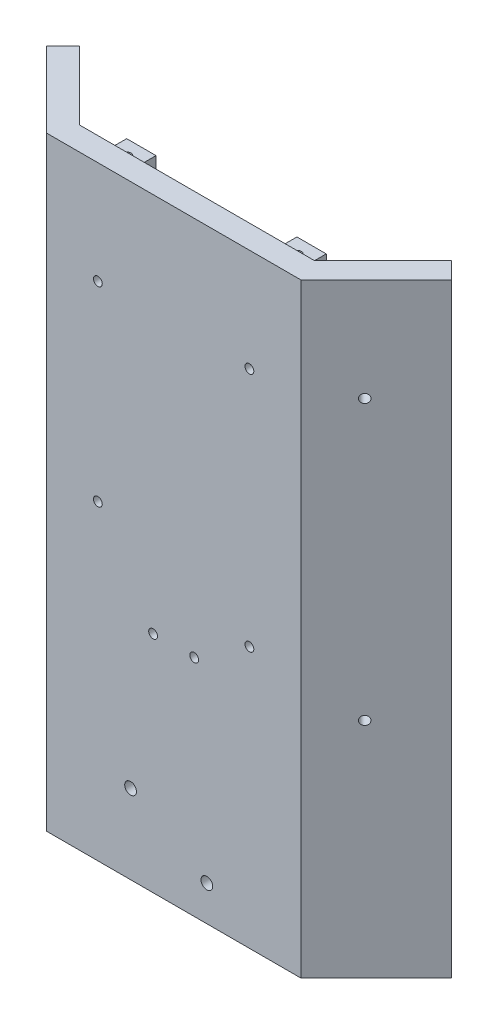
ISO-10303-21;
HEADER;
FILE_DESCRIPTION(('STEP AP214'),'2;1');
FILE_NAME('part.step','',(''),(''),'','','');
FILE_SCHEMA(('AUTOMOTIVE_DESIGN { 1 0 10303 214 1 1 1 1 }'));
ENDSEC;
DATA;
#1=APPLICATION_CONTEXT('core data for automotive mechanical design processes');
#2=APPLICATION_PROTOCOL_DEFINITION('international standard','automotive_design',2000,#1);
#3=PRODUCT_CONTEXT('',#1,'mechanical');
#4=PRODUCT('Part','Part','',(#3));
#5=PRODUCT_RELATED_PRODUCT_CATEGORY('part','',(#4));
#6=PRODUCT_DEFINITION_FORMATION('','',#4);
#7=PRODUCT_DEFINITION_CONTEXT('part definition',#1,'design');
#8=PRODUCT_DEFINITION('design','',#6,#7);
#9=PRODUCT_DEFINITION_SHAPE('','',#8);
#10=(LENGTH_UNIT() NAMED_UNIT(*) SI_UNIT(.MILLI.,.METRE.));
#11=(NAMED_UNIT(*) PLANE_ANGLE_UNIT() SI_UNIT($,.RADIAN.));
#12=(NAMED_UNIT(*) SI_UNIT($,.STERADIAN.) SOLID_ANGLE_UNIT());
#13=UNCERTAINTY_MEASURE_WITH_UNIT(LENGTH_MEASURE(1.E-05),#10,'distance_accuracy_value','');
#14=(GEOMETRIC_REPRESENTATION_CONTEXT(3) GLOBAL_UNCERTAINTY_ASSIGNED_CONTEXT((#13)) GLOBAL_UNIT_ASSIGNED_CONTEXT((#10,
#11,#12)) REPRESENTATION_CONTEXT('',''));
#15=CARTESIAN_POINT('',(0.,0.,0.));
#16=DIRECTION('',(0.,0.,1.));
#17=DIRECTION('',(1.,0.,0.));
#18=AXIS2_PLACEMENT_3D('',#15,#16,#17);
#19=CARTESIAN_POINT('',(-40.,206.,0.));
#20=DIRECTION('',(0.,0.,1.));
#21=DIRECTION('',(1.,0.,0.));
#22=AXIS2_PLACEMENT_3D('',#19,#20,#21);
#23=PLANE('',#22);
#24=CARTESIAN_POINT('',(25.8137084989848,89.,0.));
#25=DIRECTION('',(0.,0.,1.));
#26=DIRECTION('',(1.,0.,0.));
#27=AXIS2_PLACEMENT_3D('',#24,#25,#26);
#28=CIRCLE('',#27,1.5);
#29=CARTESIAN_POINT('',(27.3137084989848,89.,0.));
#30=VERTEX_POINT('',#29);
#31=EDGE_CURVE('E452',#30,#30,#28,.F.);
#32=ORIENTED_EDGE('',*,*,#31,.F.);
#33=EDGE_LOOP('',(#32));
#34=FACE_BOUND('',#33,.T.);
#35=CARTESIAN_POINT('',(-25.8137084989847,106.,0.));
#36=DIRECTION('',(0.,0.,1.));
#37=DIRECTION('',(1.,0.,0.));
#38=AXIS2_PLACEMENT_3D('',#35,#36,#37);
#39=CIRCLE('',#38,1.5);
#40=CARTESIAN_POINT('',(-24.3137084989847,106.,0.));
#41=VERTEX_POINT('',#40);
#42=EDGE_CURVE('E445',#41,#41,#39,.F.);
#43=ORIENTED_EDGE('',*,*,#42,.F.);
#44=EDGE_LOOP('',(#43));
#45=FACE_BOUND('',#44,.T.);
#46=CARTESIAN_POINT('',(25.8137084989848,171.,0.));
#47=DIRECTION('',(0.,0.,1.));
#48=DIRECTION('',(1.,0.,0.));
#49=AXIS2_PLACEMENT_3D('',#46,#47,#48);
#50=CIRCLE('',#49,1.49999999999999);
#51=CARTESIAN_POINT('',(27.3137084989848,171.,0.));
#52=VERTEX_POINT('',#51);
#53=EDGE_CURVE('E444',#52,#52,#50,.F.);
#54=ORIENTED_EDGE('',*,*,#53,.F.);
#55=EDGE_LOOP('',(#54));
#56=FACE_BOUND('',#55,.T.);
#57=CARTESIAN_POINT('',(-25.8137084989847,171.,0.));
#58=DIRECTION('',(0.,0.,1.));
#59=DIRECTION('',(1.,0.,0.));
#60=AXIS2_PLACEMENT_3D('',#57,#58,#59);
#61=CIRCLE('',#60,1.5);
#62=CARTESIAN_POINT('',(-24.3137084989847,171.,0.));
#63=VERTEX_POINT('',#62);
#64=EDGE_CURVE('E461',#63,#63,#61,.F.);
#65=ORIENTED_EDGE('',*,*,#64,.F.);
#66=EDGE_LOOP('',(#65));
#67=FACE_BOUND('',#66,.T.);
#68=CARTESIAN_POINT('',(7.,76.4040820577345,0.));
#69=DIRECTION('',(0.,0.,1.));
#70=DIRECTION('',(1.,0.,0.));
#71=AXIS2_PLACEMENT_3D('',#68,#69,#70);
#72=CIRCLE('',#71,1.5);
#73=CARTESIAN_POINT('',(8.5,76.4040820577345,0.));
#74=VERTEX_POINT('',#73);
#75=EDGE_CURVE('E468',#74,#74,#72,.F.);
#76=ORIENTED_EDGE('',*,*,#75,.F.);
#77=EDGE_LOOP('',(#76));
#78=FACE_BOUND('',#77,.T.);
#79=CARTESIAN_POINT('',(-7.,76.4040820577345,0.));
#80=DIRECTION('',(0.,0.,1.));
#81=DIRECTION('',(1.,0.,0.));
#82=AXIS2_PLACEMENT_3D('',#79,#80,#81);
#83=CIRCLE('',#82,1.5);
#84=CARTESIAN_POINT('',(-5.5,76.4040820577345,0.));
#85=VERTEX_POINT('',#84);
#86=EDGE_CURVE('E469',#85,#85,#83,.F.);
#87=ORIENTED_EDGE('',*,*,#86,.F.);
#88=EDGE_LOOP('',(#87));
#89=FACE_BOUND('',#88,.T.);
#90=CARTESIAN_POINT('',(-14.6670536145485,26.9999999999999,0.));
#91=DIRECTION('',(0.,0.,1.));
#92=DIRECTION('',(1.,0.,0.));
#93=AXIS2_PLACEMENT_3D('',#90,#91,#92);
#94=CIRCLE('',#93,2.);
#95=CARTESIAN_POINT('',(-12.6670536145485,26.9999999999999,0.));
#96=VERTEX_POINT('',#95);
#97=EDGE_CURVE('E480',#96,#96,#94,.F.);
#98=ORIENTED_EDGE('',*,*,#97,.F.);
#99=EDGE_LOOP('',(#98));
#100=FACE_BOUND('',#99,.T.);
#101=CARTESIAN_POINT('',(11.3137084989848,12.,0.));
#102=DIRECTION('',(0.,0.,1.));
#103=DIRECTION('',(1.,0.,0.));
#104=AXIS2_PLACEMENT_3D('',#101,#102,#103);
#105=CIRCLE('',#104,2.);
#106=CARTESIAN_POINT('',(13.3137084989848,12.,0.));
#107=VERTEX_POINT('',#106);
#108=EDGE_CURVE('E481',#107,#107,#105,.F.);
#109=ORIENTED_EDGE('',*,*,#108,.F.);
#110=EDGE_LOOP('',(#109));
#111=FACE_BOUND('',#110,.T.);
#112=DIRECTION('',(0.,1.,0.));
#113=VECTOR('',#112,1.);
#114=CARTESIAN_POINT('',(24.,200.,0.));
#115=LINE('',#114,#113);
#116=CARTESIAN_POINT('',(24.,194.,0.));
#117=VERTEX_POINT('',#116);
#118=CARTESIAN_POINT('',(24.,200.,0.));
#119=VERTEX_POINT('',#118);
#120=EDGE_CURVE('E166',#117,#119,#115,.T.);
#121=ORIENTED_EDGE('',*,*,#120,.F.);
#122=DIRECTION('',(-1.,0.,0.));
#123=VECTOR('',#122,1.);
#124=CARTESIAN_POINT('',(34.,194.,0.));
#125=LINE('',#124,#123);
#126=CARTESIAN_POINT('',(34.,194.,0.));
#127=VERTEX_POINT('',#126);
#128=EDGE_CURVE('E179',#127,#117,#125,.T.);
#129=ORIENTED_EDGE('',*,*,#128,.F.);
#130=DIRECTION('',(0.,-1.,0.));
#131=VECTOR('',#130,1.);
#132=CARTESIAN_POINT('',(34.,200.,0.));
#133=LINE('',#132,#131);
#134=CARTESIAN_POINT('',(34.,200.,0.));
#135=VERTEX_POINT('',#134);
#136=EDGE_CURVE('E188',#135,#127,#133,.T.);
#137=ORIENTED_EDGE('',*,*,#136,.F.);
#138=DIRECTION('',(1.,0.,0.));
#139=VECTOR('',#138,1.);
#140=CARTESIAN_POINT('',(34.,200.,0.));
#141=LINE('',#140,#139);
#142=EDGE_CURVE('E169',#119,#135,#141,.T.);
#143=ORIENTED_EDGE('',*,*,#142,.F.);
#144=EDGE_LOOP('',(#121,#129,#137,#143));
#145=FACE_BOUND('',#144,.T.);
#146=DIRECTION('',(-1.,0.,0.));
#147=VECTOR('',#146,1.);
#148=CARTESIAN_POINT('',(-40.,0.,0.));
#149=LINE('',#148,#147);
#150=CARTESIAN_POINT('',(40.,0.,0.));
#151=VERTEX_POINT('',#150);
#152=CARTESIAN_POINT('',(-40.,0.,0.));
#153=VERTEX_POINT('',#152);
#154=EDGE_CURVE('E209',#151,#153,#149,.T.);
#155=ORIENTED_EDGE('',*,*,#154,.T.);
#156=DIRECTION('',(0.,-1.,0.));
#157=VECTOR('',#156,1.);
#158=CARTESIAN_POINT('',(-40.,206.,0.));
#159=LINE('',#158,#157);
#160=CARTESIAN_POINT('',(-40.,206.,0.));
#161=VERTEX_POINT('',#160);
#162=EDGE_CURVE('E223',#161,#153,#159,.T.);
#163=ORIENTED_EDGE('',*,*,#162,.F.);
#164=DIRECTION('',(-1.,0.,0.));
#165=VECTOR('',#164,1.);
#166=CARTESIAN_POINT('',(-40.,206.,0.));
#167=LINE('',#166,#165);
#168=CARTESIAN_POINT('',(40.,206.,0.));
#169=VERTEX_POINT('',#168);
#170=EDGE_CURVE('E221',#169,#161,#167,.T.);
#171=ORIENTED_EDGE('',*,*,#170,.F.);
#172=DIRECTION('',(0.,-1.,0.));
#173=VECTOR('',#172,1.);
#174=CARTESIAN_POINT('',(40.,206.,0.));
#175=LINE('',#174,#173);
#176=EDGE_CURVE('E241',#169,#151,#175,.T.);
#177=ORIENTED_EDGE('',*,*,#176,.T.);
#178=EDGE_LOOP('',(#155,#163,#171,#177));
#179=FACE_BOUND('',#178,.T.);
#180=DIRECTION('',(0.,1.,0.));
#181=VECTOR('',#180,1.);
#182=CARTESIAN_POINT('',(-34.,200.,0.));
#183=LINE('',#182,#181);
#184=CARTESIAN_POINT('',(-34.,194.,0.));
#185=VERTEX_POINT('',#184);
#186=CARTESIAN_POINT('',(-34.,200.,0.));
#187=VERTEX_POINT('',#186);
#188=EDGE_CURVE('E165',#185,#187,#183,.T.);
#189=ORIENTED_EDGE('',*,*,#188,.F.);
#190=DIRECTION('',(-1.,0.,0.));
#191=VECTOR('',#190,1.);
#192=CARTESIAN_POINT('',(-24.,194.,0.));
#193=LINE('',#192,#191);
#194=CARTESIAN_POINT('',(-24.,194.,0.));
#195=VERTEX_POINT('',#194);
#196=EDGE_CURVE('E162',#195,#185,#193,.T.);
#197=ORIENTED_EDGE('',*,*,#196,.F.);
#198=DIRECTION('',(0.,-1.,0.));
#199=VECTOR('',#198,1.);
#200=CARTESIAN_POINT('',(-24.,200.,0.));
#201=LINE('',#200,#199);
#202=CARTESIAN_POINT('',(-24.,200.,0.));
#203=VERTEX_POINT('',#202);
#204=EDGE_CURVE('E52',#203,#195,#201,.T.);
#205=ORIENTED_EDGE('',*,*,#204,.F.);
#206=DIRECTION('',(1.,0.,0.));
#207=VECTOR('',#206,1.);
#208=CARTESIAN_POINT('',(-24.,200.,0.));
#209=LINE('',#208,#207);
#210=EDGE_CURVE('E47',#187,#203,#209,.T.);
#211=ORIENTED_EDGE('',*,*,#210,.F.);
#212=EDGE_LOOP('',(#189,#197,#205,#211));
#213=FACE_BOUND('',#212,.T.);
#214=ADVANCED_FACE('F32',(#34,#45,#56,#67,#78,#89,#100,#111,#145,#179,#213),#23,.F.);
#215=CARTESIAN_POINT('',(-40.,206.,0.));
#216=DIRECTION('',(-0.707106781186544,0.,0.707106781186551));
#217=DIRECTION('',(0.707106781186551,0.,0.707106781186544));
#218=AXIS2_PLACEMENT_3D('',#215,#216,#217);
#219=PLANE('',#218);
#220=CARTESIAN_POINT('',(-50.6985255993525,171.,-10.6985255993524));
#221=DIRECTION('',(-0.707106781186544,0.,0.707106781186551));
#222=DIRECTION('',(0.707106781186551,0.,0.707106781186544));
#223=AXIS2_PLACEMENT_3D('',#220,#221,#222);
#224=CIRCLE('',#223,1.50000000000001);
#225=CARTESIAN_POINT('',(-49.6378654275727,171.,-9.63786542757258));
#226=VERTEX_POINT('',#225);
#227=EDGE_CURVE('E435',#226,#226,#224,.F.);
#228=ORIENTED_EDGE('',*,*,#227,.F.);
#229=EDGE_LOOP('',(#228));
#230=FACE_BOUND('',#229,.T.);
#231=CARTESIAN_POINT('',(-50.6985255993525,81.,-10.6985255993524));
#232=DIRECTION('',(-0.707106781186544,0.,0.707106781186551));
#233=DIRECTION('',(0.707106781186551,0.,0.707106781186544));
#234=AXIS2_PLACEMENT_3D('',#231,#232,#233);
#235=CIRCLE('',#234,1.5);
#236=CARTESIAN_POINT('',(-49.6378654275727,81.,-9.63786542757259));
#237=VERTEX_POINT('',#236);
#238=EDGE_CURVE('E422',#237,#237,#235,.F.);
#239=ORIENTED_EDGE('',*,*,#238,.F.);
#240=EDGE_LOOP('',(#239));
#241=FACE_BOUND('',#240,.T.);
#242=DIRECTION('',(-0.707106781186551,0.,-0.707106781186544));
#243=VECTOR('',#242,1.);
#244=CARTESIAN_POINT('',(-40.,0.,0.));
#245=LINE('',#244,#243);
#246=CARTESIAN_POINT('',(-63.3345237791562,0.,-23.334523779156));
#247=VERTEX_POINT('',#246);
#248=EDGE_CURVE('E204',#153,#247,#245,.T.);
#249=ORIENTED_EDGE('',*,*,#248,.T.);
#250=DIRECTION('',(0.,-1.,0.));
#251=VECTOR('',#250,1.);
#252=CARTESIAN_POINT('',(-63.3345237791562,206.,-23.334523779156));
#253=LINE('',#252,#251);
#254=CARTESIAN_POINT('',(-63.3345237791562,206.,-23.334523779156));
#255=VERTEX_POINT('',#254);
#256=EDGE_CURVE('E11',#255,#247,#253,.T.);
#257=ORIENTED_EDGE('',*,*,#256,.F.);
#258=DIRECTION('',(-0.707106781186551,0.,-0.707106781186544));
#259=VECTOR('',#258,1.);
#260=CARTESIAN_POINT('',(-40.,206.,0.));
#261=LINE('',#260,#259);
#262=EDGE_CURVE('E205',#161,#255,#261,.T.);
#263=ORIENTED_EDGE('',*,*,#262,.F.);
#264=ORIENTED_EDGE('',*,*,#162,.T.);
#265=EDGE_LOOP('',(#249,#257,#263,#264));
#266=FACE_BOUND('',#265,.T.);
#267=ADVANCED_FACE('F34',(#230,#241,#266),#219,.F.);
#268=CARTESIAN_POINT('',(-68.9913780286485,206.,-17.6776695296635));
#269=DIRECTION('',(0.707106781186551,0.,0.707106781186544));
#270=DIRECTION('',(0.707106781186544,0.,-0.707106781186551));
#271=AXIS2_PLACEMENT_3D('',#268,#269,#270);
#272=PLANE('',#271);
#273=DIRECTION('',(-0.707106781186544,0.,0.707106781186551));
#274=VECTOR('',#273,1.);
#275=CARTESIAN_POINT('',(-68.9913780286485,0.,-17.6776695296635));
#276=LINE('',#275,#274);
#277=CARTESIAN_POINT('',(-68.9913780286485,0.,-17.6776695296635));
#278=VERTEX_POINT('',#277);
#279=EDGE_CURVE('E226',#247,#278,#276,.T.);
#280=ORIENTED_EDGE('',*,*,#279,.T.);
#281=DIRECTION('',(0.,-1.,0.));
#282=VECTOR('',#281,1.);
#283=CARTESIAN_POINT('',(-68.9913780286485,206.,-17.6776695296635));
#284=LINE('',#283,#282);
#285=CARTESIAN_POINT('',(-68.9913780286485,206.,-17.6776695296635));
#286=VERTEX_POINT('',#285);
#287=EDGE_CURVE('E40',#286,#278,#284,.T.);
#288=ORIENTED_EDGE('',*,*,#287,.F.);
#289=DIRECTION('',(-0.707106781186544,0.,0.707106781186551));
#290=VECTOR('',#289,1.);
#291=CARTESIAN_POINT('',(-68.9913780286485,206.,-17.6776695296635));
#292=LINE('',#291,#290);
#293=EDGE_CURVE('E208',#255,#286,#292,.T.);
#294=ORIENTED_EDGE('',*,*,#293,.F.);
#295=ORIENTED_EDGE('',*,*,#256,.T.);
#296=EDGE_LOOP('',(#280,#288,#294,#295));
#297=FACE_BOUND('',#296,.T.);
#298=ADVANCED_FACE('F283',(#297),#272,.F.);
#299=CARTESIAN_POINT('',(-43.3137084989847,206.,8.));
#300=DIRECTION('',(0.707106781186544,0.,-0.707106781186551));
#301=DIRECTION('',(-0.707106781186551,0.,-0.707106781186544));
#302=AXIS2_PLACEMENT_3D('',#299,#300,#301);
#303=PLANE('',#302);
#304=CARTESIAN_POINT('',(-56.3553798488449,171.,-5.04167134986));
#305=DIRECTION('',(-0.707106781186544,0.,0.707106781186551));
#306=DIRECTION('',(0.707106781186551,0.,0.707106781186544));
#307=AXIS2_PLACEMENT_3D('',#304,#305,#306);
#308=CIRCLE('',#307,1.50000000000001);
#309=CARTESIAN_POINT('',(-55.294719677065,171.,-3.98101117808018));
#310=VERTEX_POINT('',#309);
#311=EDGE_CURVE('E432',#310,#310,#308,.T.);
#312=ORIENTED_EDGE('',*,*,#311,.F.);
#313=EDGE_LOOP('',(#312));
#314=FACE_BOUND('',#313,.T.);
#315=CARTESIAN_POINT('',(-56.3553798488449,81.,-5.04167134986));
#316=DIRECTION('',(-0.707106781186544,0.,0.707106781186551));
#317=DIRECTION('',(0.707106781186551,0.,0.707106781186544));
#318=AXIS2_PLACEMENT_3D('',#315,#316,#317);
#319=CIRCLE('',#318,1.5);
#320=CARTESIAN_POINT('',(-55.294719677065,81.,-3.98101117808019));
#321=VERTEX_POINT('',#320);
#322=EDGE_CURVE('E419',#321,#321,#319,.T.);
#323=ORIENTED_EDGE('',*,*,#322,.F.);
#324=EDGE_LOOP('',(#323));
#325=FACE_BOUND('',#324,.T.);
#326=DIRECTION('',(0.707106781186551,0.,0.707106781186544));
#327=VECTOR('',#326,1.);
#328=CARTESIAN_POINT('',(-43.3137084989847,0.,8.));
#329=LINE('',#328,#327);
#330=CARTESIAN_POINT('',(-43.3137084989847,0.,8.));
#331=VERTEX_POINT('',#330);
#332=EDGE_CURVE('E228',#278,#331,#329,.T.);
#333=ORIENTED_EDGE('',*,*,#332,.T.);
#334=DIRECTION('',(0.,-1.,0.));
#335=VECTOR('',#334,1.);
#336=CARTESIAN_POINT('',(-43.3137084989847,206.,8.));
#337=LINE('',#336,#335);
#338=CARTESIAN_POINT('',(-43.3137084989847,206.,8.));
#339=VERTEX_POINT('',#338);
#340=EDGE_CURVE('E253',#339,#331,#337,.T.);
#341=ORIENTED_EDGE('',*,*,#340,.F.);
#342=DIRECTION('',(0.707106781186551,0.,0.707106781186544));
#343=VECTOR('',#342,1.);
#344=CARTESIAN_POINT('',(-43.3137084989847,206.,8.));
#345=LINE('',#344,#343);
#346=EDGE_CURVE('E211',#286,#339,#345,.T.);
#347=ORIENTED_EDGE('',*,*,#346,.F.);
#348=ORIENTED_EDGE('',*,*,#287,.T.);
#349=EDGE_LOOP('',(#333,#341,#347,#348));
#350=FACE_BOUND('',#349,.T.);
#351=ADVANCED_FACE('F260',(#314,#325,#350),#303,.F.);
#352=CARTESIAN_POINT('',(-43.3137084989847,206.,8.));
#353=DIRECTION('',(0.,0.,-1.));
#354=DIRECTION('',(-1.,0.,0.));
#355=AXIS2_PLACEMENT_3D('',#352,#353,#354);
#356=PLANE('',#355);
#357=CARTESIAN_POINT('',(25.8137084989848,89.,8.));
#358=DIRECTION('',(0.,0.,1.));
#359=DIRECTION('',(1.,0.,0.));
#360=AXIS2_PLACEMENT_3D('',#357,#358,#359);
#361=CIRCLE('',#360,1.5);
#362=CARTESIAN_POINT('',(27.3137084989848,89.,8.));
#363=VERTEX_POINT('',#362);
#364=EDGE_CURVE('E437',#363,#363,#361,.T.);
#365=ORIENTED_EDGE('',*,*,#364,.F.);
#366=EDGE_LOOP('',(#365));
#367=FACE_BOUND('',#366,.T.);
#368=CARTESIAN_POINT('',(-25.8137084989847,106.,8.));
#369=DIRECTION('',(0.,0.,1.));
#370=DIRECTION('',(1.,0.,0.));
#371=AXIS2_PLACEMENT_3D('',#368,#369,#370);
#372=CIRCLE('',#371,1.5);
#373=CARTESIAN_POINT('',(-24.3137084989847,106.,8.));
#374=VERTEX_POINT('',#373);
#375=EDGE_CURVE('E449',#374,#374,#372,.T.);
#376=ORIENTED_EDGE('',*,*,#375,.F.);
#377=EDGE_LOOP('',(#376));
#378=FACE_BOUND('',#377,.T.);
#379=CARTESIAN_POINT('',(25.8137084989848,171.,8.));
#380=DIRECTION('',(0.,0.,1.));
#381=DIRECTION('',(1.,0.,0.));
#382=AXIS2_PLACEMENT_3D('',#379,#380,#381);
#383=CIRCLE('',#382,1.49999999999999);
#384=CARTESIAN_POINT('',(27.3137084989848,171.,8.));
#385=VERTEX_POINT('',#384);
#386=EDGE_CURVE('E441',#385,#385,#383,.T.);
#387=ORIENTED_EDGE('',*,*,#386,.F.);
#388=EDGE_LOOP('',(#387));
#389=FACE_BOUND('',#388,.T.);
#390=CARTESIAN_POINT('',(-25.8137084989847,171.,8.));
#391=DIRECTION('',(0.,0.,1.));
#392=DIRECTION('',(1.,0.,0.));
#393=AXIS2_PLACEMENT_3D('',#390,#391,#392);
#394=CIRCLE('',#393,1.5);
#395=CARTESIAN_POINT('',(-24.3137084989847,171.,8.));
#396=VERTEX_POINT('',#395);
#397=EDGE_CURVE('E448',#396,#396,#394,.T.);
#398=ORIENTED_EDGE('',*,*,#397,.F.);
#399=EDGE_LOOP('',(#398));
#400=FACE_BOUND('',#399,.T.);
#401=CARTESIAN_POINT('',(7.,76.4040820577345,8.));
#402=DIRECTION('',(0.,0.,1.));
#403=DIRECTION('',(1.,0.,0.));
#404=AXIS2_PLACEMENT_3D('',#401,#402,#403);
#405=CIRCLE('',#404,1.5);
#406=CARTESIAN_POINT('',(8.5,76.4040820577345,8.));
#407=VERTEX_POINT('',#406);
#408=EDGE_CURVE('E465',#407,#407,#405,.T.);
#409=ORIENTED_EDGE('',*,*,#408,.F.);
#410=EDGE_LOOP('',(#409));
#411=FACE_BOUND('',#410,.T.);
#412=CARTESIAN_POINT('',(-7.,76.4040820577345,8.));
#413=DIRECTION('',(0.,0.,1.));
#414=DIRECTION('',(1.,0.,0.));
#415=AXIS2_PLACEMENT_3D('',#412,#413,#414);
#416=CIRCLE('',#415,1.5);
#417=CARTESIAN_POINT('',(-5.5,76.4040820577345,8.));
#418=VERTEX_POINT('',#417);
#419=EDGE_CURVE('E464',#418,#418,#416,.T.);
#420=ORIENTED_EDGE('',*,*,#419,.F.);
#421=EDGE_LOOP('',(#420));
#422=FACE_BOUND('',#421,.T.);
#423=CARTESIAN_POINT('',(-14.6670536145485,26.9999999999999,8.));
#424=DIRECTION('',(0.,0.,1.));
#425=DIRECTION('',(1.,0.,0.));
#426=AXIS2_PLACEMENT_3D('',#423,#424,#425);
#427=CIRCLE('',#426,2.);
#428=CARTESIAN_POINT('',(-12.6670536145485,26.9999999999999,8.));
#429=VERTEX_POINT('',#428);
#430=EDGE_CURVE('E477',#429,#429,#427,.T.);
#431=ORIENTED_EDGE('',*,*,#430,.F.);
#432=EDGE_LOOP('',(#431));
#433=FACE_BOUND('',#432,.T.);
#434=CARTESIAN_POINT('',(11.3137084989848,12.,8.));
#435=DIRECTION('',(0.,0.,1.));
#436=DIRECTION('',(1.,0.,0.));
#437=AXIS2_PLACEMENT_3D('',#434,#435,#436);
#438=CIRCLE('',#437,2.);
#439=CARTESIAN_POINT('',(13.3137084989848,12.,8.));
#440=VERTEX_POINT('',#439);
#441=EDGE_CURVE('E472',#440,#440,#438,.T.);
#442=ORIENTED_EDGE('',*,*,#441,.F.);
#443=EDGE_LOOP('',(#442));
#444=FACE_BOUND('',#443,.T.);
#445=DIRECTION('',(1.,0.,0.));
#446=VECTOR('',#445,1.);
#447=CARTESIAN_POINT('',(-43.3137084989847,0.,8.));
#448=LINE('',#447,#446);
#449=CARTESIAN_POINT('',(43.3137084989848,0.,8.));
#450=VERTEX_POINT('',#449);
#451=EDGE_CURVE('E230',#331,#450,#448,.T.);
#452=ORIENTED_EDGE('',*,*,#451,.T.);
#453=DIRECTION('',(0.,-1.,0.));
#454=VECTOR('',#453,1.);
#455=CARTESIAN_POINT('',(43.3137084989848,206.,8.));
#456=LINE('',#455,#454);
#457=CARTESIAN_POINT('',(43.3137084989848,206.,8.));
#458=VERTEX_POINT('',#457);
#459=EDGE_CURVE('E250',#458,#450,#456,.T.);
#460=ORIENTED_EDGE('',*,*,#459,.F.);
#461=DIRECTION('',(1.,0.,0.));
#462=VECTOR('',#461,1.);
#463=CARTESIAN_POINT('',(-43.3137084989847,206.,8.));
#464=LINE('',#463,#462);
#465=EDGE_CURVE('E213',#339,#458,#464,.T.);
#466=ORIENTED_EDGE('',*,*,#465,.F.);
#467=ORIENTED_EDGE('',*,*,#340,.T.);
#468=EDGE_LOOP('',(#452,#460,#466,#467));
#469=FACE_BOUND('',#468,.T.);
#470=ADVANCED_FACE('F271',(#367,#378,#389,#400,#411,#422,#433,#444,#469),#356,.F.);
#471=CARTESIAN_POINT('',(43.3137084989848,206.,8.));
#472=DIRECTION('',(-0.707106781186549,0.,-0.707106781186546));
#473=DIRECTION('',(-0.707106781186546,0.,0.707106781186549));
#474=AXIS2_PLACEMENT_3D('',#471,#472,#473);
#475=PLANE('',#474);
#476=CARTESIAN_POINT('',(54.2128463018496,171.,-2.89913780286484));
#477=DIRECTION('',(0.707106781186549,0.,0.707106781186546));
#478=DIRECTION('',(0.707106781186546,0.,-0.707106781186549));
#479=AXIS2_PLACEMENT_3D('',#476,#477,#478);
#480=CIRCLE('',#479,1.50000000000001);
#481=CARTESIAN_POINT('',(55.2735064736294,171.,-3.95979797464467));
#482=VERTEX_POINT('',#481);
#483=EDGE_CURVE('E415',#482,#482,#480,.T.);
#484=ORIENTED_EDGE('',*,*,#483,.F.);
#485=EDGE_LOOP('',(#484));
#486=FACE_BOUND('',#485,.T.);
#487=CARTESIAN_POINT('',(54.2128463018496,76.,-2.89913780286484));
#488=DIRECTION('',(0.707106781186549,0.,0.707106781186546));
#489=DIRECTION('',(0.707106781186546,0.,-0.707106781186549));
#490=AXIS2_PLACEMENT_3D('',#487,#488,#489);
#491=CIRCLE('',#490,1.5);
#492=CARTESIAN_POINT('',(55.2735064736294,76.,-3.95979797464467));
#493=VERTEX_POINT('',#492);
#494=EDGE_CURVE('E427',#493,#493,#491,.T.);
#495=ORIENTED_EDGE('',*,*,#494,.F.);
#496=EDGE_LOOP('',(#495));
#497=FACE_BOUND('',#496,.T.);
#498=DIRECTION('',(0.707106781186546,0.,-0.707106781186549));
#499=VECTOR('',#498,1.);
#500=CARTESIAN_POINT('',(43.3137084989848,0.,8.));
#501=LINE('',#500,#499);
#502=CARTESIAN_POINT('',(68.9913780286484,0.,-17.6776695296637));
#503=VERTEX_POINT('',#502);
#504=EDGE_CURVE('E232',#450,#503,#501,.T.);
#505=ORIENTED_EDGE('',*,*,#504,.T.);
#506=DIRECTION('',(0.,-1.,0.));
#507=VECTOR('',#506,1.);
#508=CARTESIAN_POINT('',(68.9913780286484,206.,-17.6776695296637));
#509=LINE('',#508,#507);
#510=CARTESIAN_POINT('',(68.9913780286484,206.,-17.6776695296637));
#511=VERTEX_POINT('',#510);
#512=EDGE_CURVE('E247',#511,#503,#509,.T.);
#513=ORIENTED_EDGE('',*,*,#512,.F.);
#514=DIRECTION('',(0.707106781186546,0.,-0.707106781186549));
#515=VECTOR('',#514,1.);
#516=CARTESIAN_POINT('',(43.3137084989848,206.,8.));
#517=LINE('',#516,#515);
#518=EDGE_CURVE('E215',#458,#511,#517,.T.);
#519=ORIENTED_EDGE('',*,*,#518,.F.);
#520=ORIENTED_EDGE('',*,*,#459,.T.);
#521=EDGE_LOOP('',(#505,#513,#519,#520));
#522=FACE_BOUND('',#521,.T.);
#523=ADVANCED_FACE('F275',(#486,#497,#522),#475,.F.);
#524=CARTESIAN_POINT('',(68.9913780286484,206.,-17.6776695296637));
#525=DIRECTION('',(-0.707106781186546,0.,0.707106781186549));
#526=DIRECTION('',(0.707106781186549,0.,0.707106781186546));
#527=AXIS2_PLACEMENT_3D('',#524,#525,#526);
#528=PLANE('',#527);
#529=DIRECTION('',(-0.707106781186549,0.,-0.707106781186546));
#530=VECTOR('',#529,1.);
#531=CARTESIAN_POINT('',(68.9913780286484,0.,-17.6776695296637));
#532=LINE('',#531,#530);
#533=CARTESIAN_POINT('',(63.334523779156,0.,-23.3345237791561));
#534=VERTEX_POINT('',#533);
#535=EDGE_CURVE('E234',#503,#534,#532,.T.);
#536=ORIENTED_EDGE('',*,*,#535,.T.);
#537=DIRECTION('',(0.,-1.,0.));
#538=VECTOR('',#537,1.);
#539=CARTESIAN_POINT('',(63.334523779156,206.,-23.3345237791561));
#540=LINE('',#539,#538);
#541=CARTESIAN_POINT('',(63.334523779156,206.,-23.3345237791561));
#542=VERTEX_POINT('',#541);
#543=EDGE_CURVE('E244',#542,#534,#540,.T.);
#544=ORIENTED_EDGE('',*,*,#543,.F.);
#545=DIRECTION('',(-0.707106781186549,0.,-0.707106781186546));
#546=VECTOR('',#545,1.);
#547=CARTESIAN_POINT('',(68.9913780286484,206.,-17.6776695296637));
#548=LINE('',#547,#546);
#549=EDGE_CURVE('E217',#511,#542,#548,.T.);
#550=ORIENTED_EDGE('',*,*,#549,.F.);
#551=ORIENTED_EDGE('',*,*,#512,.T.);
#552=EDGE_LOOP('',(#536,#544,#550,#551));
#553=FACE_BOUND('',#552,.T.);
#554=ADVANCED_FACE('F295',(#553),#528,.F.);
#555=CARTESIAN_POINT('',(40.,206.,0.));
#556=DIRECTION('',(0.707106781186549,0.,0.707106781186546));
#557=DIRECTION('',(0.707106781186546,0.,-0.707106781186549));
#558=AXIS2_PLACEMENT_3D('',#555,#556,#557);
#559=PLANE('',#558);
#560=CARTESIAN_POINT('',(48.5559920523572,171.,-8.55599205235721));
#561=DIRECTION('',(0.707106781186549,0.,0.707106781186546));
#562=DIRECTION('',(0.707106781186546,0.,-0.707106781186549));
#563=AXIS2_PLACEMENT_3D('',#560,#561,#562);
#564=CIRCLE('',#563,1.50000000000001);
#565=CARTESIAN_POINT('',(49.616652224137,171.,-9.61665222413704));
#566=VERTEX_POINT('',#565);
#567=EDGE_CURVE('E418',#566,#566,#564,.F.);
#568=ORIENTED_EDGE('',*,*,#567,.F.);
#569=EDGE_LOOP('',(#568));
#570=FACE_BOUND('',#569,.T.);
#571=CARTESIAN_POINT('',(48.5559920523572,76.,-8.55599205235721));
#572=DIRECTION('',(0.707106781186549,0.,0.707106781186546));
#573=DIRECTION('',(0.707106781186546,0.,-0.707106781186549));
#574=AXIS2_PLACEMENT_3D('',#571,#572,#573);
#575=CIRCLE('',#574,1.5);
#576=CARTESIAN_POINT('',(49.616652224137,76.,-9.61665222413704));
#577=VERTEX_POINT('',#576);
#578=EDGE_CURVE('E424',#577,#577,#575,.F.);
#579=ORIENTED_EDGE('',*,*,#578,.F.);
#580=EDGE_LOOP('',(#579));
#581=FACE_BOUND('',#580,.T.);
#582=DIRECTION('',(-0.707106781186546,0.,0.707106781186549));
#583=VECTOR('',#582,1.);
#584=CARTESIAN_POINT('',(40.,0.,0.));
#585=LINE('',#584,#583);
#586=EDGE_CURVE('E236',#534,#151,#585,.T.);
#587=ORIENTED_EDGE('',*,*,#586,.T.);
#588=ORIENTED_EDGE('',*,*,#176,.F.);
#589=DIRECTION('',(-0.707106781186546,0.,0.707106781186549));
#590=VECTOR('',#589,1.);
#591=CARTESIAN_POINT('',(40.,206.,0.));
#592=LINE('',#591,#590);
#593=EDGE_CURVE('E219',#542,#169,#592,.T.);
#594=ORIENTED_EDGE('',*,*,#593,.F.);
#595=ORIENTED_EDGE('',*,*,#543,.T.);
#596=EDGE_LOOP('',(#587,#588,#594,#595));
#597=FACE_BOUND('',#596,.T.);
#598=ADVANCED_FACE('F293',(#570,#581,#597),#559,.F.);
#599=CARTESIAN_POINT('',(0.,206.,0.));
#600=DIRECTION('',(0.,-1.,0.));
#601=DIRECTION('',(0.,0.,-1.));
#602=AXIS2_PLACEMENT_3D('',#599,#600,#601);
#603=PLANE('',#602);
#604=ORIENTED_EDGE('',*,*,#262,.T.);
#605=ORIENTED_EDGE('',*,*,#293,.T.);
#606=ORIENTED_EDGE('',*,*,#346,.T.);
#607=ORIENTED_EDGE('',*,*,#465,.T.);
#608=ORIENTED_EDGE('',*,*,#518,.T.);
#609=ORIENTED_EDGE('',*,*,#549,.T.);
#610=ORIENTED_EDGE('',*,*,#593,.T.);
#611=ORIENTED_EDGE('',*,*,#170,.T.);
#612=EDGE_LOOP('',(#604,#605,#606,#607,#608,#609,#610,#611));
#613=FACE_BOUND('',#612,.T.);
#614=ADVANCED_FACE('F279',(#613),#603,.F.);
#615=CARTESIAN_POINT('',(0.,0.,0.));
#616=DIRECTION('',(0.,-1.,0.));
#617=DIRECTION('',(0.,0.,-1.));
#618=AXIS2_PLACEMENT_3D('',#615,#616,#617);
#619=PLANE('',#618);
#620=ORIENTED_EDGE('',*,*,#248,.F.);
#621=ORIENTED_EDGE('',*,*,#154,.F.);
#622=ORIENTED_EDGE('',*,*,#586,.F.);
#623=ORIENTED_EDGE('',*,*,#535,.F.);
#624=ORIENTED_EDGE('',*,*,#504,.F.);
#625=ORIENTED_EDGE('',*,*,#451,.F.);
#626=ORIENTED_EDGE('',*,*,#332,.F.);
#627=ORIENTED_EDGE('',*,*,#279,.F.);
#628=EDGE_LOOP('',(#620,#621,#622,#623,#624,#625,#626,#627));
#629=FACE_BOUND('',#628,.T.);
#630=ADVANCED_FACE('F266',(#629),#619,.T.);
#631=CARTESIAN_POINT('',(24.,200.,-10.));
#632=DIRECTION('',(1.,0.,0.));
#633=DIRECTION('',(0.,0.,-1.));
#634=AXIS2_PLACEMENT_3D('',#631,#632,#633);
#635=PLANE('',#634);
#636=ORIENTED_EDGE('',*,*,#120,.T.);
#637=DIRECTION('',(0.,0.,1.));
#638=VECTOR('',#637,1.);
#639=CARTESIAN_POINT('',(24.,200.,-10.));
#640=LINE('',#639,#638);
#641=CARTESIAN_POINT('',(24.,200.,-10.));
#642=VERTEX_POINT('',#641);
#643=EDGE_CURVE('E201',#642,#119,#640,.T.);
#644=ORIENTED_EDGE('',*,*,#643,.F.);
#645=DIRECTION('',(0.,1.,0.));
#646=VECTOR('',#645,1.);
#647=CARTESIAN_POINT('',(24.,200.,-10.));
#648=LINE('',#647,#646);
#649=CARTESIAN_POINT('',(24.,194.,-10.));
#650=VERTEX_POINT('',#649);
#651=EDGE_CURVE('E175',#650,#642,#648,.T.);
#652=ORIENTED_EDGE('',*,*,#651,.F.);
#653=DIRECTION('',(0.,0.,1.));
#654=VECTOR('',#653,1.);
#655=CARTESIAN_POINT('',(24.,194.,-10.));
#656=LINE('',#655,#654);
#657=EDGE_CURVE('E184',#650,#117,#656,.T.);
#658=ORIENTED_EDGE('',*,*,#657,.T.);
#659=EDGE_LOOP('',(#636,#644,#652,#658));
#660=FACE_BOUND('',#659,.T.);
#661=ADVANCED_FACE('F318',(#660),#635,.F.);
#662=CARTESIAN_POINT('',(34.,200.,-10.));
#663=DIRECTION('',(0.,-1.,0.));
#664=DIRECTION('',(1.,0.,0.));
#665=AXIS2_PLACEMENT_3D('',#662,#663,#664);
#666=PLANE('',#665);
#667=CARTESIAN_POINT('',(29.,200.,-5.));
#668=DIRECTION('',(0.,1.,0.));
#669=DIRECTION('',(-1.,0.,0.));
#670=AXIS2_PLACEMENT_3D('',#667,#668,#669);
#671=CIRCLE('',#670,1.50000000000001);
#672=CARTESIAN_POINT('',(27.5,200.,-5.));
#673=VERTEX_POINT('',#672);
#674=EDGE_CURVE('E484',#673,#673,#671,.T.);
#675=ORIENTED_EDGE('',*,*,#674,.F.);
#676=EDGE_LOOP('',(#675));
#677=FACE_BOUND('',#676,.T.);
#678=ORIENTED_EDGE('',*,*,#142,.T.);
#679=DIRECTION('',(0.,0.,1.));
#680=VECTOR('',#679,1.);
#681=CARTESIAN_POINT('',(34.,200.,-10.));
#682=LINE('',#681,#680);
#683=CARTESIAN_POINT('',(34.,200.,-10.));
#684=VERTEX_POINT('',#683);
#685=EDGE_CURVE('E198',#684,#135,#682,.T.);
#686=ORIENTED_EDGE('',*,*,#685,.F.);
#687=DIRECTION('',(1.,0.,0.));
#688=VECTOR('',#687,1.);
#689=CARTESIAN_POINT('',(34.,200.,-10.));
#690=LINE('',#689,#688);
#691=EDGE_CURVE('E178',#642,#684,#690,.T.);
#692=ORIENTED_EDGE('',*,*,#691,.F.);
#693=ORIENTED_EDGE('',*,*,#643,.T.);
#694=EDGE_LOOP('',(#678,#686,#692,#693));
#695=FACE_BOUND('',#694,.T.);
#696=ADVANCED_FACE('F323',(#677,#695),#666,.F.);
#697=CARTESIAN_POINT('',(34.,200.,-10.));
#698=DIRECTION('',(-1.,0.,0.));
#699=DIRECTION('',(0.,0.,1.));
#700=AXIS2_PLACEMENT_3D('',#697,#698,#699);
#701=PLANE('',#700);
#702=ORIENTED_EDGE('',*,*,#136,.T.);
#703=DIRECTION('',(0.,0.,1.));
#704=VECTOR('',#703,1.);
#705=CARTESIAN_POINT('',(34.,194.,-10.));
#706=LINE('',#705,#704);
#707=CARTESIAN_POINT('',(34.,194.,-10.));
#708=VERTEX_POINT('',#707);
#709=EDGE_CURVE('E195',#708,#127,#706,.T.);
#710=ORIENTED_EDGE('',*,*,#709,.F.);
#711=DIRECTION('',(0.,-1.,0.));
#712=VECTOR('',#711,1.);
#713=CARTESIAN_POINT('',(34.,200.,-10.));
#714=LINE('',#713,#712);
#715=EDGE_CURVE('E181',#684,#708,#714,.T.);
#716=ORIENTED_EDGE('',*,*,#715,.F.);
#717=ORIENTED_EDGE('',*,*,#685,.T.);
#718=EDGE_LOOP('',(#702,#710,#716,#717));
#719=FACE_BOUND('',#718,.T.);
#720=ADVANCED_FACE('F327',(#719),#701,.F.);
#721=CARTESIAN_POINT('',(34.,194.,-10.));
#722=DIRECTION('',(0.,1.,0.));
#723=DIRECTION('',(0.,0.,1.));
#724=AXIS2_PLACEMENT_3D('',#721,#722,#723);
#725=PLANE('',#724);
#726=CARTESIAN_POINT('',(29.,194.,-5.));
#727=DIRECTION('',(0.,1.,0.));
#728=DIRECTION('',(0.,0.,1.));
#729=AXIS2_PLACEMENT_3D('',#726,#727,#728);
#730=CIRCLE('',#729,1.50000000000001);
#731=CARTESIAN_POINT('',(29.,194.,-3.49999999999999));
#732=VERTEX_POINT('',#731);
#733=EDGE_CURVE('E493',#732,#732,#730,.F.);
#734=ORIENTED_EDGE('',*,*,#733,.F.);
#735=EDGE_LOOP('',(#734));
#736=FACE_BOUND('',#735,.T.);
#737=ORIENTED_EDGE('',*,*,#128,.T.);
#738=ORIENTED_EDGE('',*,*,#657,.F.);
#739=DIRECTION('',(-1.,0.,0.));
#740=VECTOR('',#739,1.);
#741=CARTESIAN_POINT('',(34.,194.,-10.));
#742=LINE('',#741,#740);
#743=EDGE_CURVE('E183',#708,#650,#742,.T.);
#744=ORIENTED_EDGE('',*,*,#743,.F.);
#745=ORIENTED_EDGE('',*,*,#709,.T.);
#746=EDGE_LOOP('',(#737,#738,#744,#745));
#747=FACE_BOUND('',#746,.T.);
#748=ADVANCED_FACE('F331',(#736,#747),#725,.F.);
#749=CARTESIAN_POINT('',(0.,0.,-10.));
#750=DIRECTION('',(0.,0.,-1.));
#751=DIRECTION('',(-1.,0.,0.));
#752=AXIS2_PLACEMENT_3D('',#749,#750,#751);
#753=PLANE('',#752);
#754=ORIENTED_EDGE('',*,*,#651,.T.);
#755=ORIENTED_EDGE('',*,*,#691,.T.);
#756=ORIENTED_EDGE('',*,*,#715,.T.);
#757=ORIENTED_EDGE('',*,*,#743,.T.);
#758=EDGE_LOOP('',(#754,#755,#756,#757));
#759=FACE_BOUND('',#758,.T.);
#760=ADVANCED_FACE('F335',(#759),#753,.T.);
#761=CARTESIAN_POINT('',(-34.,200.,-9.99999999999999));
#762=DIRECTION('',(1.,0.,0.));
#763=DIRECTION('',(0.,0.,-1.));
#764=AXIS2_PLACEMENT_3D('',#761,#762,#763);
#765=PLANE('',#764);
#766=ORIENTED_EDGE('',*,*,#188,.T.);
#767=DIRECTION('',(0.,0.,1.));
#768=VECTOR('',#767,1.);
#769=CARTESIAN_POINT('',(-34.,200.,-9.99999999999999));
#770=LINE('',#769,#768);
#771=CARTESIAN_POINT('',(-34.,200.,-9.99999999999999));
#772=VERTEX_POINT('',#771);
#773=EDGE_CURVE('E146',#772,#187,#770,.T.);
#774=ORIENTED_EDGE('',*,*,#773,.F.);
#775=DIRECTION('',(0.,1.,0.));
#776=VECTOR('',#775,1.);
#777=CARTESIAN_POINT('',(-34.,200.,-9.99999999999999));
#778=LINE('',#777,#776);
#779=CARTESIAN_POINT('',(-34.,194.,-9.99999999999999));
#780=VERTEX_POINT('',#779);
#781=EDGE_CURVE('E153',#780,#772,#778,.T.);
#782=ORIENTED_EDGE('',*,*,#781,.F.);
#783=DIRECTION('',(0.,0.,1.));
#784=VECTOR('',#783,1.);
#785=CARTESIAN_POINT('',(-34.,194.,-9.99999999999999));
#786=LINE('',#785,#784);
#787=EDGE_CURVE('E502',#780,#185,#786,.T.);
#788=ORIENTED_EDGE('',*,*,#787,.T.);
#789=EDGE_LOOP('',(#766,#774,#782,#788));
#790=FACE_BOUND('',#789,.T.);
#791=ADVANCED_FACE('F164',(#790),#765,.F.);
#792=CARTESIAN_POINT('',(-24.,200.,-9.99999999999999));
#793=DIRECTION('',(0.,-1.,0.));
#794=DIRECTION('',(0.,0.,-1.));
#795=AXIS2_PLACEMENT_3D('',#792,#793,#794);
#796=PLANE('',#795);
#797=CARTESIAN_POINT('',(-29.,200.,-5.));
#798=DIRECTION('',(0.,1.,0.));
#799=DIRECTION('',(-1.,0.,0.));
#800=AXIS2_PLACEMENT_3D('',#797,#798,#799);
#801=CIRCLE('',#800,1.5);
#802=CARTESIAN_POINT('',(-30.5,200.,-5.));
#803=VERTEX_POINT('',#802);
#804=EDGE_CURVE('E489',#803,#803,#801,.T.);
#805=ORIENTED_EDGE('',*,*,#804,.F.);
#806=EDGE_LOOP('',(#805));
#807=FACE_BOUND('',#806,.T.);
#808=ORIENTED_EDGE('',*,*,#210,.T.);
#809=DIRECTION('',(0.,0.,1.));
#810=VECTOR('',#809,1.);
#811=CARTESIAN_POINT('',(-24.,200.,-9.99999999999999));
#812=LINE('',#811,#810);
#813=CARTESIAN_POINT('',(-24.,200.,-9.99999999999999));
#814=VERTEX_POINT('',#813);
#815=EDGE_CURVE('E149',#814,#203,#812,.T.);
#816=ORIENTED_EDGE('',*,*,#815,.F.);
#817=DIRECTION('',(1.,0.,0.));
#818=VECTOR('',#817,1.);
#819=CARTESIAN_POINT('',(-24.,200.,-9.99999999999999));
#820=LINE('',#819,#818);
#821=EDGE_CURVE('E142',#772,#814,#820,.T.);
#822=ORIENTED_EDGE('',*,*,#821,.F.);
#823=ORIENTED_EDGE('',*,*,#773,.T.);
#824=EDGE_LOOP('',(#808,#816,#822,#823));
#825=FACE_BOUND('',#824,.T.);
#826=ADVANCED_FACE('F144',(#807,#825),#796,.F.);
#827=CARTESIAN_POINT('',(-24.,200.,-9.99999999999999));
#828=DIRECTION('',(-1.,0.,0.));
#829=DIRECTION('',(0.,0.,1.));
#830=AXIS2_PLACEMENT_3D('',#827,#828,#829);
#831=PLANE('',#830);
#832=ORIENTED_EDGE('',*,*,#204,.T.);
#833=DIRECTION('',(0.,0.,1.));
#834=VECTOR('',#833,1.);
#835=CARTESIAN_POINT('',(-24.,194.,-9.99999999999999));
#836=LINE('',#835,#834);
#837=CARTESIAN_POINT('',(-24.,194.,-9.99999999999999));
#838=VERTEX_POINT('',#837);
#839=EDGE_CURVE('E171',#838,#195,#836,.T.);
#840=ORIENTED_EDGE('',*,*,#839,.F.);
#841=DIRECTION('',(0.,-1.,0.));
#842=VECTOR('',#841,1.);
#843=CARTESIAN_POINT('',(-24.,200.,-9.99999999999999));
#844=LINE('',#843,#842);
#845=EDGE_CURVE('E152',#814,#838,#844,.T.);
#846=ORIENTED_EDGE('',*,*,#845,.F.);
#847=ORIENTED_EDGE('',*,*,#815,.T.);
#848=EDGE_LOOP('',(#832,#840,#846,#847));
#849=FACE_BOUND('',#848,.T.);
#850=ADVANCED_FACE('F344',(#849),#831,.F.);
#851=CARTESIAN_POINT('',(-24.,194.,-9.99999999999999));
#852=DIRECTION('',(0.,1.,0.));
#853=DIRECTION('',(0.,0.,1.));
#854=AXIS2_PLACEMENT_3D('',#851,#852,#853);
#855=PLANE('',#854);
#856=CARTESIAN_POINT('',(-29.,194.,-5.));
#857=DIRECTION('',(0.,1.,0.));
#858=DIRECTION('',(0.,0.,1.));
#859=AXIS2_PLACEMENT_3D('',#856,#857,#858);
#860=CIRCLE('',#859,1.5);
#861=CARTESIAN_POINT('',(-29.,194.,-3.5));
#862=VERTEX_POINT('',#861);
#863=EDGE_CURVE('E492',#862,#862,#860,.F.);
#864=ORIENTED_EDGE('',*,*,#863,.F.);
#865=EDGE_LOOP('',(#864));
#866=FACE_BOUND('',#865,.T.);
#867=ORIENTED_EDGE('',*,*,#196,.T.);
#868=ORIENTED_EDGE('',*,*,#787,.F.);
#869=DIRECTION('',(-1.,0.,0.));
#870=VECTOR('',#869,1.);
#871=CARTESIAN_POINT('',(-24.,194.,-9.99999999999999));
#872=LINE('',#871,#870);
#873=EDGE_CURVE('E158',#838,#780,#872,.T.);
#874=ORIENTED_EDGE('',*,*,#873,.F.);
#875=ORIENTED_EDGE('',*,*,#839,.T.);
#876=EDGE_LOOP('',(#867,#868,#874,#875));
#877=FACE_BOUND('',#876,.T.);
#878=ADVANCED_FACE('F348',(#866,#877),#855,.F.);
#879=CARTESIAN_POINT('',(0.,0.,-10.));
#880=DIRECTION('',(0.,0.,-1.));
#881=DIRECTION('',(-1.,0.,0.));
#882=AXIS2_PLACEMENT_3D('',#879,#880,#881);
#883=PLANE('',#882);
#884=ORIENTED_EDGE('',*,*,#781,.T.);
#885=ORIENTED_EDGE('',*,*,#821,.T.);
#886=ORIENTED_EDGE('',*,*,#845,.T.);
#887=ORIENTED_EDGE('',*,*,#873,.T.);
#888=EDGE_LOOP('',(#884,#885,#886,#887));
#889=FACE_BOUND('',#888,.T.);
#890=ADVANCED_FACE('F156',(#889),#883,.T.);
#891=CARTESIAN_POINT('',(-29.0000000000006,-0.00100000000011202,-5.));
#892=DIRECTION('',(0.,1.,0.));
#893=DIRECTION('',(-1.,0.,0.));
#894=AXIS2_PLACEMENT_3D('',#891,#892,#893);
#895=CYLINDRICAL_SURFACE('',#894,1.5);
#896=ORIENTED_EDGE('',*,*,#804,.T.);
#897=EDGE_LOOP('',(#896));
#898=FACE_BOUND('',#897,.T.);
#899=ORIENTED_EDGE('',*,*,#863,.T.);
#900=EDGE_LOOP('',(#899));
#901=FACE_BOUND('',#900,.T.);
#902=ADVANCED_FACE('F355',(#898,#901),#895,.F.);
#903=CARTESIAN_POINT('',(28.9999999999994,-0.00100000000027856,-5.));
#904=DIRECTION('',(0.,1.,0.));
#905=DIRECTION('',(-1.,0.,0.));
#906=AXIS2_PLACEMENT_3D('',#903,#904,#905);
#907=CYLINDRICAL_SURFACE('',#906,1.50000000000001);
#908=ORIENTED_EDGE('',*,*,#674,.T.);
#909=EDGE_LOOP('',(#908));
#910=FACE_BOUND('',#909,.T.);
#911=ORIENTED_EDGE('',*,*,#733,.T.);
#912=EDGE_LOOP('',(#911));
#913=FACE_BOUND('',#912,.T.);
#914=ADVANCED_FACE('F356',(#910,#913),#907,.F.);
#915=CARTESIAN_POINT('',(11.3137084989848,12.,-23.3355237791561));
#916=DIRECTION('',(0.,0.,1.));
#917=DIRECTION('',(1.,0.,0.));
#918=AXIS2_PLACEMENT_3D('',#915,#916,#917);
#919=CYLINDRICAL_SURFACE('',#918,2.);
#920=ORIENTED_EDGE('',*,*,#441,.T.);
#921=EDGE_LOOP('',(#920));
#922=FACE_BOUND('',#921,.T.);
#923=ORIENTED_EDGE('',*,*,#108,.T.);
#924=EDGE_LOOP('',(#923));
#925=FACE_BOUND('',#924,.T.);
#926=ADVANCED_FACE('F359',(#922,#925),#919,.F.);
#927=CARTESIAN_POINT('',(-14.6670536145485,26.9999999999999,-23.3355237791561));
#928=DIRECTION('',(0.,0.,1.));
#929=DIRECTION('',(1.,0.,0.));
#930=AXIS2_PLACEMENT_3D('',#927,#928,#929);
#931=CYLINDRICAL_SURFACE('',#930,2.);
#932=ORIENTED_EDGE('',*,*,#430,.T.);
#933=EDGE_LOOP('',(#932));
#934=FACE_BOUND('',#933,.T.);
#935=ORIENTED_EDGE('',*,*,#97,.T.);
#936=EDGE_LOOP('',(#935));
#937=FACE_BOUND('',#936,.T.);
#938=ADVANCED_FACE('F366',(#934,#937),#931,.F.);
#939=CARTESIAN_POINT('',(-7.,76.4040820577345,-23.3355237791561));
#940=DIRECTION('',(0.,0.,1.));
#941=DIRECTION('',(1.,0.,0.));
#942=AXIS2_PLACEMENT_3D('',#939,#940,#941);
#943=CYLINDRICAL_SURFACE('',#942,1.5);
#944=ORIENTED_EDGE('',*,*,#419,.T.);
#945=EDGE_LOOP('',(#944));
#946=FACE_BOUND('',#945,.T.);
#947=ORIENTED_EDGE('',*,*,#86,.T.);
#948=EDGE_LOOP('',(#947));
#949=FACE_BOUND('',#948,.T.);
#950=ADVANCED_FACE('F370',(#946,#949),#943,.F.);
#951=CARTESIAN_POINT('',(7.,76.4040820577345,-23.3355237791561));
#952=DIRECTION('',(0.,0.,1.));
#953=DIRECTION('',(1.,0.,0.));
#954=AXIS2_PLACEMENT_3D('',#951,#952,#953);
#955=CYLINDRICAL_SURFACE('',#954,1.5);
#956=ORIENTED_EDGE('',*,*,#408,.T.);
#957=EDGE_LOOP('',(#956));
#958=FACE_BOUND('',#957,.T.);
#959=ORIENTED_EDGE('',*,*,#75,.T.);
#960=EDGE_LOOP('',(#959));
#961=FACE_BOUND('',#960,.T.);
#962=ADVANCED_FACE('F374',(#958,#961),#955,.F.);
#963=CARTESIAN_POINT('',(-25.8137084989847,171.,-23.3355237791561));
#964=DIRECTION('',(0.,0.,1.));
#965=DIRECTION('',(1.,0.,0.));
#966=AXIS2_PLACEMENT_3D('',#963,#964,#965);
#967=CYLINDRICAL_SURFACE('',#966,1.5);
#968=ORIENTED_EDGE('',*,*,#397,.T.);
#969=EDGE_LOOP('',(#968));
#970=FACE_BOUND('',#969,.T.);
#971=ORIENTED_EDGE('',*,*,#64,.T.);
#972=EDGE_LOOP('',(#971));
#973=FACE_BOUND('',#972,.T.);
#974=ADVANCED_FACE('F378',(#970,#973),#967,.F.);
#975=CARTESIAN_POINT('',(25.8137084989848,171.,-23.3355237791561));
#976=DIRECTION('',(0.,0.,1.));
#977=DIRECTION('',(1.,0.,0.));
#978=AXIS2_PLACEMENT_3D('',#975,#976,#977);
#979=CYLINDRICAL_SURFACE('',#978,1.49999999999999);
#980=ORIENTED_EDGE('',*,*,#386,.T.);
#981=EDGE_LOOP('',(#980));
#982=FACE_BOUND('',#981,.T.);
#983=ORIENTED_EDGE('',*,*,#53,.T.);
#984=EDGE_LOOP('',(#983));
#985=FACE_BOUND('',#984,.T.);
#986=ADVANCED_FACE('F382',(#982,#985),#979,.F.);
#987=CARTESIAN_POINT('',(-25.8137084989847,106.,-23.3355237791561));
#988=DIRECTION('',(0.,0.,1.));
#989=DIRECTION('',(1.,0.,0.));
#990=AXIS2_PLACEMENT_3D('',#987,#988,#989);
#991=CYLINDRICAL_SURFACE('',#990,1.5);
#992=ORIENTED_EDGE('',*,*,#375,.T.);
#993=EDGE_LOOP('',(#992));
#994=FACE_BOUND('',#993,.T.);
#995=ORIENTED_EDGE('',*,*,#42,.T.);
#996=EDGE_LOOP('',(#995));
#997=FACE_BOUND('',#996,.T.);
#998=ADVANCED_FACE('F388',(#994,#997),#991,.F.);
#999=CARTESIAN_POINT('',(25.8137084989848,89.,-23.3355237791561));
#1000=DIRECTION('',(0.,0.,1.));
#1001=DIRECTION('',(1.,0.,0.));
#1002=AXIS2_PLACEMENT_3D('',#999,#1000,#1001);
#1003=CYLINDRICAL_SURFACE('',#1002,1.5);
#1004=ORIENTED_EDGE('',*,*,#364,.T.);
#1005=EDGE_LOOP('',(#1004));
#1006=FACE_BOUND('',#1005,.T.);
#1007=ORIENTED_EDGE('',*,*,#31,.T.);
#1008=EDGE_LOOP('',(#1007));
#1009=FACE_BOUND('',#1008,.T.);
#1010=ADVANCED_FACE('F384',(#1006,#1009),#1003,.F.);
#1011=CARTESIAN_POINT('',(15.4654253045492,81.,-76.8624765032548));
#1012=DIRECTION('',(-0.707106781186544,0.,0.707106781186551));
#1013=DIRECTION('',(0.707106781186551,0.,0.707106781186544));
#1014=AXIS2_PLACEMENT_3D('',#1011,#1012,#1013);
#1015=CYLINDRICAL_SURFACE('',#1014,1.5);
#1016=ORIENTED_EDGE('',*,*,#322,.T.);
#1017=EDGE_LOOP('',(#1016));
#1018=FACE_BOUND('',#1017,.T.);
#1019=ORIENTED_EDGE('',*,*,#238,.T.);
#1020=EDGE_LOOP('',(#1019));
#1021=FACE_BOUND('',#1020,.T.);
#1022=ADVANCED_FACE('F387',(#1018,#1021),#1015,.F.);
#1023=CARTESIAN_POINT('',(15.4654253045492,171.,-76.8624765032548));
#1024=DIRECTION('',(-0.707106781186544,0.,0.707106781186551));
#1025=DIRECTION('',(0.707106781186551,0.,0.707106781186544));
#1026=AXIS2_PLACEMENT_3D('',#1023,#1024,#1025);
#1027=CYLINDRICAL_SURFACE('',#1026,1.50000000000001);
#1028=ORIENTED_EDGE('',*,*,#311,.T.);
#1029=EDGE_LOOP('',(#1028));
#1030=FACE_BOUND('',#1029,.T.);
#1031=ORIENTED_EDGE('',*,*,#227,.T.);
#1032=EDGE_LOOP('',(#1031));
#1033=FACE_BOUND('',#1032,.T.);
#1034=ADVANCED_FACE('F398',(#1030,#1033),#1027,.F.);
#1035=CARTESIAN_POINT('',(-17.6079588515453,76.,-74.7199429562595));
#1036=DIRECTION('',(0.707106781186549,0.,0.707106781186546));
#1037=DIRECTION('',(0.707106781186546,0.,-0.707106781186549));
#1038=AXIS2_PLACEMENT_3D('',#1035,#1036,#1037);
#1039=CYLINDRICAL_SURFACE('',#1038,1.5);
#1040=ORIENTED_EDGE('',*,*,#494,.T.);
#1041=EDGE_LOOP('',(#1040));
#1042=FACE_BOUND('',#1041,.T.);
#1043=ORIENTED_EDGE('',*,*,#578,.T.);
#1044=EDGE_LOOP('',(#1043));
#1045=FACE_BOUND('',#1044,.T.);
#1046=ADVANCED_FACE('F402',(#1042,#1045),#1039,.F.);
#1047=CARTESIAN_POINT('',(-17.6079588515453,171.,-74.7199429562595));
#1048=DIRECTION('',(0.707106781186549,0.,0.707106781186546));
#1049=DIRECTION('',(0.707106781186546,0.,-0.707106781186549));
#1050=AXIS2_PLACEMENT_3D('',#1047,#1048,#1049);
#1051=CYLINDRICAL_SURFACE('',#1050,1.50000000000001);
#1052=ORIENTED_EDGE('',*,*,#483,.T.);
#1053=EDGE_LOOP('',(#1052));
#1054=FACE_BOUND('',#1053,.T.);
#1055=ORIENTED_EDGE('',*,*,#567,.T.);
#1056=EDGE_LOOP('',(#1055));
#1057=FACE_BOUND('',#1056,.T.);
#1058=ADVANCED_FACE('F406',(#1054,#1057),#1051,.F.);
#1059=CLOSED_SHELL('',(#214,#267,#298,#351,#470,#523,#554,#598,#614,#630,#661,#696,#720,#748,
#760,#791,#826,#850,#878,#890,#902,#914,#926,#938,#950,#962,#974,#986,#998,#1010,#1022,#1034,
#1046,#1058));
#1060=MANIFOLD_SOLID_BREP('B2',#1059);
#1061=ADVANCED_BREP_SHAPE_REPRESENTATION('',(#18,#1060),#14);
#1062=SHAPE_DEFINITION_REPRESENTATION(#9,#1061);
ENDSEC;
END-ISO-10303-21;
